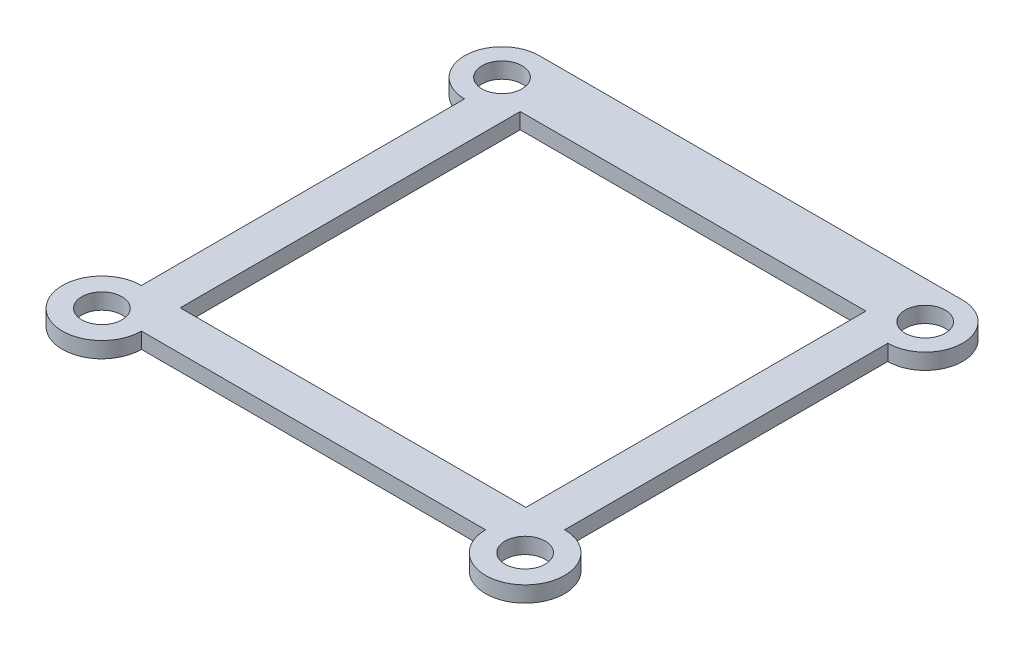
ISO-10303-21;
HEADER;
FILE_DESCRIPTION(('STEP AP214'),'2;1');
FILE_NAME('part.step','',(''),(''),'','','');
FILE_SCHEMA(('AUTOMOTIVE_DESIGN { 1 0 10303 214 1 1 1 1 }'));
ENDSEC;
DATA;
#1=APPLICATION_CONTEXT('core data for automotive mechanical design processes');
#2=APPLICATION_PROTOCOL_DEFINITION('international standard','automotive_design',2000,#1);
#3=PRODUCT_CONTEXT('',#1,'mechanical');
#4=PRODUCT('Part','Part','',(#3));
#5=PRODUCT_RELATED_PRODUCT_CATEGORY('part','',(#4));
#6=PRODUCT_DEFINITION_FORMATION('','',#4);
#7=PRODUCT_DEFINITION_CONTEXT('part definition',#1,'design');
#8=PRODUCT_DEFINITION('design','',#6,#7);
#9=PRODUCT_DEFINITION_SHAPE('','',#8);
#10=(LENGTH_UNIT() NAMED_UNIT(*) SI_UNIT(.MILLI.,.METRE.));
#11=(NAMED_UNIT(*) PLANE_ANGLE_UNIT() SI_UNIT($,.RADIAN.));
#12=(NAMED_UNIT(*) SI_UNIT($,.STERADIAN.) SOLID_ANGLE_UNIT());
#13=UNCERTAINTY_MEASURE_WITH_UNIT(LENGTH_MEASURE(1.E-05),#10,'distance_accuracy_value','');
#14=(GEOMETRIC_REPRESENTATION_CONTEXT(3) GLOBAL_UNCERTAINTY_ASSIGNED_CONTEXT((#13)) GLOBAL_UNIT_ASSIGNED_CONTEXT((#10,
#11,#12)) REPRESENTATION_CONTEXT('',''));
#15=CARTESIAN_POINT('',(0.,0.,0.));
#16=DIRECTION('',(0.,0.,1.));
#17=DIRECTION('',(1.,0.,0.));
#18=AXIS2_PLACEMENT_3D('',#15,#16,#17);
#19=CARTESIAN_POINT('',(-8.84,1.4,-13.0811034941735));
#20=DIRECTION('',(0.,1.,0.));
#21=DIRECTION('',(0.,0.,1.));
#22=AXIS2_PLACEMENT_3D('',#19,#20,#21);
#23=PLANE('',#22);
#24=CARTESIAN_POINT('',(-8.84,1.4,-13.0811034941735));
#25=DIRECTION('',(0.,1.,0.));
#26=DIRECTION('',(0.,0.,1.));
#27=AXIS2_PLACEMENT_3D('',#24,#25,#26);
#28=CIRCLE('',#27,1.77004043483272);
#29=CARTESIAN_POINT('',(-8.84,1.4,-11.3110630593408));
#30=VERTEX_POINT('',#29);
#31=EDGE_CURVE('E164',#30,#30,#28,.T.);
#32=ORIENTED_EDGE('',*,*,#31,.F.);
#33=EDGE_LOOP('',(#32));
#34=FACE_BOUND('',#33,.T.);
#35=CARTESIAN_POINT('',(-8.84,1.4,-48.3811034941736));
#36=DIRECTION('',(0.,1.,0.));
#37=DIRECTION('',(0.,0.,1.));
#38=AXIS2_PLACEMENT_3D('',#35,#36,#37);
#39=CIRCLE('',#38,1.77004043483272);
#40=CARTESIAN_POINT('',(-8.84,1.4,-46.6110630593408));
#41=VERTEX_POINT('',#40);
#42=EDGE_CURVE('E176',#41,#41,#39,.T.);
#43=ORIENTED_EDGE('',*,*,#42,.F.);
#44=EDGE_LOOP('',(#43));
#45=FACE_BOUND('',#44,.T.);
#46=CARTESIAN_POINT('',(-8.84,1.4,-13.0811034941735));
#47=DIRECTION('',(0.,1.,0.));
#48=DIRECTION('',(0.,0.,1.));
#49=AXIS2_PLACEMENT_3D('',#46,#47,#48);
#50=CIRCLE('',#49,3.48791185901081);
#51=CARTESIAN_POINT('',(-8.84,1.4,-16.5690153531844));
#52=VERTEX_POINT('',#51);
#53=CARTESIAN_POINT('',(-5.35208814098919,1.4,-13.0811034941735));
#54=VERTEX_POINT('',#53);
#55=EDGE_CURVE('E182',#52,#54,#50,.T.);
#56=ORIENTED_EDGE('',*,*,#55,.T.);
#57=DIRECTION('',(1.,0.,0.));
#58=VECTOR('',#57,1.);
#59=CARTESIAN_POINT('',(-5.35208814098919,1.4,-13.0811034941735));
#60=LINE('',#59,#58);
#61=CARTESIAN_POINT('',(25.0120881409892,1.4,-13.0811034941735));
#62=VERTEX_POINT('',#61);
#63=EDGE_CURVE('E185',#54,#62,#60,.T.);
#64=ORIENTED_EDGE('',*,*,#63,.T.);
#65=CARTESIAN_POINT('',(28.5,1.4,-13.0811034941735));
#66=DIRECTION('',(0.,1.,0.));
#67=DIRECTION('',(0.,0.,-1.));
#68=AXIS2_PLACEMENT_3D('',#65,#66,#67);
#69=CIRCLE('',#68,3.48791185901081);
#70=CARTESIAN_POINT('',(28.5,1.4,-16.5690153531844));
#71=VERTEX_POINT('',#70);
#72=EDGE_CURVE('E188',#62,#71,#69,.T.);
#73=ORIENTED_EDGE('',*,*,#72,.T.);
#74=DIRECTION('',(0.,0.,-1.));
#75=VECTOR('',#74,1.);
#76=CARTESIAN_POINT('',(28.5,1.4,-45.0811034941735));
#77=LINE('',#76,#75);
#78=CARTESIAN_POINT('',(28.5,1.4,-45.0811034941735));
#79=VERTEX_POINT('',#78);
#80=EDGE_CURVE('E190',#71,#79,#77,.T.);
#81=ORIENTED_EDGE('',*,*,#80,.T.);
#82=CARTESIAN_POINT('',(28.5,1.4,-48.3811034941736));
#83=DIRECTION('',(0.,1.,0.));
#84=DIRECTION('',(0.,0.,-1.));
#85=AXIS2_PLACEMENT_3D('',#82,#83,#84);
#86=CIRCLE('',#85,3.3);
#87=CARTESIAN_POINT('',(28.5,1.4,-51.6811034941736));
#88=VERTEX_POINT('',#87);
#89=EDGE_CURVE('E192',#79,#88,#86,.T.);
#90=ORIENTED_EDGE('',*,*,#89,.T.);
#91=DIRECTION('',(-1.,0.,0.));
#92=VECTOR('',#91,1.);
#93=CARTESIAN_POINT('',(-8.84,1.4,-51.6811034941736));
#94=LINE('',#93,#92);
#95=CARTESIAN_POINT('',(-8.84,1.4,-51.6811034941736));
#96=VERTEX_POINT('',#95);
#97=EDGE_CURVE('E194',#88,#96,#94,.T.);
#98=ORIENTED_EDGE('',*,*,#97,.T.);
#99=CARTESIAN_POINT('',(-8.84,1.4,-48.3811034941736));
#100=DIRECTION('',(0.,1.,0.));
#101=DIRECTION('',(0.,0.,1.));
#102=AXIS2_PLACEMENT_3D('',#99,#100,#101);
#103=CIRCLE('',#102,3.3);
#104=CARTESIAN_POINT('',(-8.84,1.4,-45.0811034941735));
#105=VERTEX_POINT('',#104);
#106=EDGE_CURVE('E196',#96,#105,#103,.T.);
#107=ORIENTED_EDGE('',*,*,#106,.T.);
#108=DIRECTION('',(0.,0.,1.));
#109=VECTOR('',#108,1.);
#110=CARTESIAN_POINT('',(-8.84,1.4,-45.0811034941735));
#111=LINE('',#110,#109);
#112=EDGE_CURVE('E198',#105,#52,#111,.T.);
#113=ORIENTED_EDGE('',*,*,#112,.T.);
#114=EDGE_LOOP('',(#56,#64,#73,#81,#90,#98,#107,#113));
#115=FACE_BOUND('',#114,.T.);
#116=CARTESIAN_POINT('',(28.5,1.4,-48.3811034941736));
#117=DIRECTION('',(0.,1.,0.));
#118=DIRECTION('',(0.,0.,1.));
#119=AXIS2_PLACEMENT_3D('',#116,#117,#118);
#120=CIRCLE('',#119,1.77004043483272);
#121=CARTESIAN_POINT('',(28.5,1.4,-46.6110630593408));
#122=VERTEX_POINT('',#121);
#123=EDGE_CURVE('E170',#122,#122,#120,.T.);
#124=ORIENTED_EDGE('',*,*,#123,.F.);
#125=EDGE_LOOP('',(#124));
#126=FACE_BOUND('',#125,.T.);
#127=CARTESIAN_POINT('',(28.5,1.4,-13.0811034941735));
#128=DIRECTION('',(0.,1.,0.));
#129=DIRECTION('',(0.,0.,1.));
#130=AXIS2_PLACEMENT_3D('',#127,#128,#129);
#131=CIRCLE('',#130,1.77004043483272);
#132=CARTESIAN_POINT('',(28.5,1.4,-11.3110630593408));
#133=VERTEX_POINT('',#132);
#134=EDGE_CURVE('E158',#133,#133,#131,.T.);
#135=ORIENTED_EDGE('',*,*,#134,.F.);
#136=EDGE_LOOP('',(#135));
#137=FACE_BOUND('',#136,.T.);
#138=DIRECTION('',(1.,0.,0.));
#139=VECTOR('',#138,1.);
#140=CARTESIAN_POINT('',(-5.41999999999999,1.4,-16.5690153531844));
#141=LINE('',#140,#139);
#142=CARTESIAN_POINT('',(-5.41999999999999,1.4,-16.5690153531844));
#143=VERTEX_POINT('',#142);
#144=CARTESIAN_POINT('',(25.08,1.4,-16.5690153531844));
#145=VERTEX_POINT('',#144);
#146=EDGE_CURVE('E130',#143,#145,#141,.T.);
#147=ORIENTED_EDGE('',*,*,#146,.F.);
#148=DIRECTION('',(0.,0.,1.));
#149=VECTOR('',#148,1.);
#150=CARTESIAN_POINT('',(-5.42,1.4,-46.5690153531844));
#151=LINE('',#150,#149);
#152=CARTESIAN_POINT('',(-5.42,1.4,-46.5690153531844));
#153=VERTEX_POINT('',#152);
#154=EDGE_CURVE('E122',#153,#143,#151,.T.);
#155=ORIENTED_EDGE('',*,*,#154,.F.);
#156=DIRECTION('',(-1.,0.,0.));
#157=VECTOR('',#156,1.);
#158=CARTESIAN_POINT('',(-5.42,1.4,-46.5690153531844));
#159=LINE('',#158,#157);
#160=CARTESIAN_POINT('',(25.08,1.4,-46.5690153531844));
#161=VERTEX_POINT('',#160);
#162=EDGE_CURVE('E144',#161,#153,#159,.T.);
#163=ORIENTED_EDGE('',*,*,#162,.F.);
#164=DIRECTION('',(0.,0.,-1.));
#165=VECTOR('',#164,1.);
#166=CARTESIAN_POINT('',(25.08,1.4,-46.5690153531844));
#167=LINE('',#166,#165);
#168=EDGE_CURVE('E142',#145,#161,#167,.T.);
#169=ORIENTED_EDGE('',*,*,#168,.F.);
#170=EDGE_LOOP('',(#147,#155,#163,#169));
#171=FACE_BOUND('',#170,.T.);
#172=ADVANCED_FACE('F33',(#34,#45,#115,#126,#137,#171),#23,.T.);
#173=CARTESIAN_POINT('',(-8.84,0.,-13.0811034941735));
#174=DIRECTION('',(0.,1.,0.));
#175=DIRECTION('',(0.,0.,1.));
#176=AXIS2_PLACEMENT_3D('',#173,#174,#175);
#177=PLANE('',#176);
#178=CARTESIAN_POINT('',(28.5,0.,-13.0811034941735));
#179=DIRECTION('',(0.,1.,0.));
#180=DIRECTION('',(0.,0.,1.));
#181=AXIS2_PLACEMENT_3D('',#178,#179,#180);
#182=CIRCLE('',#181,1.77004043483272);
#183=CARTESIAN_POINT('',(28.5,0.,-11.3110630593408));
#184=VERTEX_POINT('',#183);
#185=EDGE_CURVE('E138',#184,#184,#182,.T.);
#186=ORIENTED_EDGE('',*,*,#185,.T.);
#187=EDGE_LOOP('',(#186));
#188=FACE_BOUND('',#187,.T.);
#189=CARTESIAN_POINT('',(-8.84,0.,-13.0811034941735));
#190=DIRECTION('',(0.,1.,0.));
#191=DIRECTION('',(0.,0.,1.));
#192=AXIS2_PLACEMENT_3D('',#189,#190,#191);
#193=CIRCLE('',#192,1.77004043483272);
#194=CARTESIAN_POINT('',(-8.84,0.,-11.3110630593408));
#195=VERTEX_POINT('',#194);
#196=EDGE_CURVE('E161',#195,#195,#193,.T.);
#197=ORIENTED_EDGE('',*,*,#196,.T.);
#198=EDGE_LOOP('',(#197));
#199=FACE_BOUND('',#198,.T.);
#200=CARTESIAN_POINT('',(28.5,0.,-48.3811034941736));
#201=DIRECTION('',(0.,1.,0.));
#202=DIRECTION('',(0.,0.,1.));
#203=AXIS2_PLACEMENT_3D('',#200,#201,#202);
#204=CIRCLE('',#203,1.77004043483272);
#205=CARTESIAN_POINT('',(28.5,0.,-46.6110630593408));
#206=VERTEX_POINT('',#205);
#207=EDGE_CURVE('E167',#206,#206,#204,.T.);
#208=ORIENTED_EDGE('',*,*,#207,.T.);
#209=EDGE_LOOP('',(#208));
#210=FACE_BOUND('',#209,.T.);
#211=CARTESIAN_POINT('',(-8.84,0.,-48.3811034941736));
#212=DIRECTION('',(0.,1.,0.));
#213=DIRECTION('',(0.,0.,1.));
#214=AXIS2_PLACEMENT_3D('',#211,#212,#213);
#215=CIRCLE('',#214,1.77004043483272);
#216=CARTESIAN_POINT('',(-8.84,0.,-46.6110630593408));
#217=VERTEX_POINT('',#216);
#218=EDGE_CURVE('E173',#217,#217,#215,.T.);
#219=ORIENTED_EDGE('',*,*,#218,.T.);
#220=EDGE_LOOP('',(#219));
#221=FACE_BOUND('',#220,.T.);
#222=CARTESIAN_POINT('',(-8.84,0.,-13.0811034941735));
#223=DIRECTION('',(0.,1.,0.));
#224=DIRECTION('',(0.,0.,1.));
#225=AXIS2_PLACEMENT_3D('',#222,#223,#224);
#226=CIRCLE('',#225,3.48791185901081);
#227=CARTESIAN_POINT('',(-8.84,0.,-16.5690153531844));
#228=VERTEX_POINT('',#227);
#229=CARTESIAN_POINT('',(-5.35208814098919,0.,-13.0811034941735));
#230=VERTEX_POINT('',#229);
#231=EDGE_CURVE('E179',#228,#230,#226,.T.);
#232=ORIENTED_EDGE('',*,*,#231,.F.);
#233=DIRECTION('',(0.,0.,1.));
#234=VECTOR('',#233,1.);
#235=CARTESIAN_POINT('',(-8.84,0.,-45.0811034941735));
#236=LINE('',#235,#234);
#237=CARTESIAN_POINT('',(-8.84,0.,-45.0811034941735));
#238=VERTEX_POINT('',#237);
#239=EDGE_CURVE('E186',#238,#228,#236,.T.);
#240=ORIENTED_EDGE('',*,*,#239,.F.);
#241=CARTESIAN_POINT('',(-8.84,0.,-48.3811034941736));
#242=DIRECTION('',(0.,1.,0.));
#243=DIRECTION('',(0.,0.,1.));
#244=AXIS2_PLACEMENT_3D('',#241,#242,#243);
#245=CIRCLE('',#244,3.3);
#246=CARTESIAN_POINT('',(-8.84,0.,-51.6811034941736));
#247=VERTEX_POINT('',#246);
#248=EDGE_CURVE('E213',#247,#238,#245,.T.);
#249=ORIENTED_EDGE('',*,*,#248,.F.);
#250=DIRECTION('',(-1.,0.,0.));
#251=VECTOR('',#250,1.);
#252=CARTESIAN_POINT('',(-8.84,0.,-51.6811034941736));
#253=LINE('',#252,#251);
#254=CARTESIAN_POINT('',(28.5,0.,-51.6811034941736));
#255=VERTEX_POINT('',#254);
#256=EDGE_CURVE('E211',#255,#247,#253,.T.);
#257=ORIENTED_EDGE('',*,*,#256,.F.);
#258=CARTESIAN_POINT('',(28.5,0.,-48.3811034941736));
#259=DIRECTION('',(0.,1.,0.));
#260=DIRECTION('',(0.,0.,-1.));
#261=AXIS2_PLACEMENT_3D('',#258,#259,#260);
#262=CIRCLE('',#261,3.3);
#263=CARTESIAN_POINT('',(28.5,0.,-45.0811034941735));
#264=VERTEX_POINT('',#263);
#265=EDGE_CURVE('E209',#264,#255,#262,.T.);
#266=ORIENTED_EDGE('',*,*,#265,.F.);
#267=DIRECTION('',(0.,0.,-1.));
#268=VECTOR('',#267,1.);
#269=CARTESIAN_POINT('',(28.5,0.,-45.0811034941735));
#270=LINE('',#269,#268);
#271=CARTESIAN_POINT('',(28.5,0.,-16.5690153531844));
#272=VERTEX_POINT('',#271);
#273=EDGE_CURVE('E207',#272,#264,#270,.T.);
#274=ORIENTED_EDGE('',*,*,#273,.F.);
#275=CARTESIAN_POINT('',(28.5,0.,-13.0811034941735));
#276=DIRECTION('',(0.,1.,0.));
#277=DIRECTION('',(0.,0.,-1.));
#278=AXIS2_PLACEMENT_3D('',#275,#276,#277);
#279=CIRCLE('',#278,3.48791185901081);
#280=CARTESIAN_POINT('',(25.0120881409892,0.,-13.0811034941735));
#281=VERTEX_POINT('',#280);
#282=EDGE_CURVE('E205',#281,#272,#279,.T.);
#283=ORIENTED_EDGE('',*,*,#282,.F.);
#284=DIRECTION('',(1.,0.,0.));
#285=VECTOR('',#284,1.);
#286=CARTESIAN_POINT('',(-5.35208814098919,0.,-13.0811034941735));
#287=LINE('',#286,#285);
#288=EDGE_CURVE('E203',#230,#281,#287,.T.);
#289=ORIENTED_EDGE('',*,*,#288,.F.);
#290=EDGE_LOOP('',(#232,#240,#249,#257,#266,#274,#283,#289));
#291=FACE_BOUND('',#290,.T.);
#292=DIRECTION('',(0.,0.,1.));
#293=VECTOR('',#292,1.);
#294=CARTESIAN_POINT('',(-5.42,0.,-46.5690153531844));
#295=LINE('',#294,#293);
#296=CARTESIAN_POINT('',(-5.42,0.,-46.5690153531844));
#297=VERTEX_POINT('',#296);
#298=CARTESIAN_POINT('',(-5.41999999999999,0.,-16.5690153531844));
#299=VERTEX_POINT('',#298);
#300=EDGE_CURVE('E56',#297,#299,#295,.T.);
#301=ORIENTED_EDGE('',*,*,#300,.T.);
#302=DIRECTION('',(1.,0.,0.));
#303=VECTOR('',#302,1.);
#304=CARTESIAN_POINT('',(-5.41999999999999,0.,-16.5690153531844));
#305=LINE('',#304,#303);
#306=CARTESIAN_POINT('',(25.08,0.,-16.5690153531844));
#307=VERTEX_POINT('',#306);
#308=EDGE_CURVE('E137',#299,#307,#305,.T.);
#309=ORIENTED_EDGE('',*,*,#308,.T.);
#310=DIRECTION('',(0.,0.,-1.));
#311=VECTOR('',#310,1.);
#312=CARTESIAN_POINT('',(25.08,0.,-46.5690153531844));
#313=LINE('',#312,#311);
#314=CARTESIAN_POINT('',(25.08,0.,-46.5690153531844));
#315=VERTEX_POINT('',#314);
#316=EDGE_CURVE('E150',#307,#315,#313,.T.);
#317=ORIENTED_EDGE('',*,*,#316,.T.);
#318=DIRECTION('',(-1.,0.,0.));
#319=VECTOR('',#318,1.);
#320=CARTESIAN_POINT('',(-5.42,0.,-46.5690153531844));
#321=LINE('',#320,#319);
#322=EDGE_CURVE('E131',#315,#297,#321,.T.);
#323=ORIENTED_EDGE('',*,*,#322,.T.);
#324=EDGE_LOOP('',(#301,#309,#317,#323));
#325=FACE_BOUND('',#324,.T.);
#326=ADVANCED_FACE('F243',(#188,#199,#210,#221,#291,#325),#177,.F.);
#327=CARTESIAN_POINT('',(-8.84,1.4,-13.0811034941735));
#328=DIRECTION('',(0.,-1.,0.));
#329=DIRECTION('',(0.,0.,-1.));
#330=AXIS2_PLACEMENT_3D('',#327,#328,#329);
#331=CYLINDRICAL_SURFACE('',#330,3.48791185901081);
#332=ORIENTED_EDGE('',*,*,#231,.T.);
#333=DIRECTION('',(0.,-1.,0.));
#334=VECTOR('',#333,1.);
#335=CARTESIAN_POINT('',(-5.35208814098919,1.4,-13.0811034941735));
#336=LINE('',#335,#334);
#337=EDGE_CURVE('E11',#54,#230,#336,.T.);
#338=ORIENTED_EDGE('',*,*,#337,.F.);
#339=ORIENTED_EDGE('',*,*,#55,.F.);
#340=DIRECTION('',(0.,-1.,0.));
#341=VECTOR('',#340,1.);
#342=CARTESIAN_POINT('',(-8.84,1.4,-16.5690153531844));
#343=LINE('',#342,#341);
#344=EDGE_CURVE('E200',#52,#228,#343,.T.);
#345=ORIENTED_EDGE('',*,*,#344,.T.);
#346=EDGE_LOOP('',(#332,#338,#339,#345));
#347=FACE_BOUND('',#346,.T.);
#348=ADVANCED_FACE('F35',(#347),#331,.T.);
#349=CARTESIAN_POINT('',(-5.35208814098919,1.4,-13.0811034941735));
#350=DIRECTION('',(0.,0.,-1.));
#351=DIRECTION('',(-1.,0.,0.));
#352=AXIS2_PLACEMENT_3D('',#349,#350,#351);
#353=PLANE('',#352);
#354=ORIENTED_EDGE('',*,*,#288,.T.);
#355=DIRECTION('',(0.,-1.,0.));
#356=VECTOR('',#355,1.);
#357=CARTESIAN_POINT('',(25.0120881409892,1.4,-13.0811034941735));
#358=LINE('',#357,#356);
#359=EDGE_CURVE('E41',#62,#281,#358,.T.);
#360=ORIENTED_EDGE('',*,*,#359,.F.);
#361=ORIENTED_EDGE('',*,*,#63,.F.);
#362=ORIENTED_EDGE('',*,*,#337,.T.);
#363=EDGE_LOOP('',(#354,#360,#361,#362));
#364=FACE_BOUND('',#363,.T.);
#365=ADVANCED_FACE('F261',(#364),#353,.F.);
#366=CARTESIAN_POINT('',(28.5,1.4,-13.0811034941735));
#367=DIRECTION('',(0.,-1.,0.));
#368=DIRECTION('',(0.,0.,-1.));
#369=AXIS2_PLACEMENT_3D('',#366,#367,#368);
#370=CYLINDRICAL_SURFACE('',#369,3.48791185901081);
#371=ORIENTED_EDGE('',*,*,#282,.T.);
#372=DIRECTION('',(0.,-1.,0.));
#373=VECTOR('',#372,1.);
#374=CARTESIAN_POINT('',(28.5,1.4,-16.5690153531844));
#375=LINE('',#374,#373);
#376=EDGE_CURVE('E230',#71,#272,#375,.T.);
#377=ORIENTED_EDGE('',*,*,#376,.F.);
#378=ORIENTED_EDGE('',*,*,#72,.F.);
#379=ORIENTED_EDGE('',*,*,#359,.T.);
#380=EDGE_LOOP('',(#371,#377,#378,#379));
#381=FACE_BOUND('',#380,.T.);
#382=ADVANCED_FACE('F237',(#381),#370,.T.);
#383=CARTESIAN_POINT('',(28.5,1.4,-45.0811034941735));
#384=DIRECTION('',(-1.,0.,0.));
#385=DIRECTION('',(0.,0.,1.));
#386=AXIS2_PLACEMENT_3D('',#383,#384,#385);
#387=PLANE('',#386);
#388=ORIENTED_EDGE('',*,*,#273,.T.);
#389=DIRECTION('',(0.,-1.,0.));
#390=VECTOR('',#389,1.);
#391=CARTESIAN_POINT('',(28.5,1.4,-45.0811034941735));
#392=LINE('',#391,#390);
#393=EDGE_CURVE('E227',#79,#264,#392,.T.);
#394=ORIENTED_EDGE('',*,*,#393,.F.);
#395=ORIENTED_EDGE('',*,*,#80,.F.);
#396=ORIENTED_EDGE('',*,*,#376,.T.);
#397=EDGE_LOOP('',(#388,#394,#395,#396));
#398=FACE_BOUND('',#397,.T.);
#399=ADVANCED_FACE('F249',(#398),#387,.F.);
#400=CARTESIAN_POINT('',(28.5,1.4,-48.3811034941736));
#401=DIRECTION('',(0.,-1.,0.));
#402=DIRECTION('',(0.,0.,-1.));
#403=AXIS2_PLACEMENT_3D('',#400,#401,#402);
#404=CYLINDRICAL_SURFACE('',#403,3.3);
#405=ORIENTED_EDGE('',*,*,#265,.T.);
#406=DIRECTION('',(0.,-1.,0.));
#407=VECTOR('',#406,1.);
#408=CARTESIAN_POINT('',(28.5,1.4,-51.6811034941736));
#409=LINE('',#408,#407);
#410=EDGE_CURVE('E224',#88,#255,#409,.T.);
#411=ORIENTED_EDGE('',*,*,#410,.F.);
#412=ORIENTED_EDGE('',*,*,#89,.F.);
#413=ORIENTED_EDGE('',*,*,#393,.T.);
#414=EDGE_LOOP('',(#405,#411,#412,#413));
#415=FACE_BOUND('',#414,.T.);
#416=ADVANCED_FACE('F253',(#415),#404,.T.);
#417=CARTESIAN_POINT('',(-8.84,1.4,-51.6811034941736));
#418=DIRECTION('',(0.,0.,1.));
#419=DIRECTION('',(1.,0.,0.));
#420=AXIS2_PLACEMENT_3D('',#417,#418,#419);
#421=PLANE('',#420);
#422=ORIENTED_EDGE('',*,*,#256,.T.);
#423=DIRECTION('',(0.,-1.,0.));
#424=VECTOR('',#423,1.);
#425=CARTESIAN_POINT('',(-8.84,1.4,-51.6811034941736));
#426=LINE('',#425,#424);
#427=EDGE_CURVE('E221',#96,#247,#426,.T.);
#428=ORIENTED_EDGE('',*,*,#427,.F.);
#429=ORIENTED_EDGE('',*,*,#97,.F.);
#430=ORIENTED_EDGE('',*,*,#410,.T.);
#431=EDGE_LOOP('',(#422,#428,#429,#430));
#432=FACE_BOUND('',#431,.T.);
#433=ADVANCED_FACE('F274',(#432),#421,.F.);
#434=CARTESIAN_POINT('',(-8.84,1.4,-48.3811034941736));
#435=DIRECTION('',(0.,-1.,0.));
#436=DIRECTION('',(0.,0.,-1.));
#437=AXIS2_PLACEMENT_3D('',#434,#435,#436);
#438=CYLINDRICAL_SURFACE('',#437,3.3);
#439=ORIENTED_EDGE('',*,*,#248,.T.);
#440=DIRECTION('',(0.,-1.,0.));
#441=VECTOR('',#440,1.);
#442=CARTESIAN_POINT('',(-8.84,1.4,-45.0811034941735));
#443=LINE('',#442,#441);
#444=EDGE_CURVE('E218',#105,#238,#443,.T.);
#445=ORIENTED_EDGE('',*,*,#444,.F.);
#446=ORIENTED_EDGE('',*,*,#106,.F.);
#447=ORIENTED_EDGE('',*,*,#427,.T.);
#448=EDGE_LOOP('',(#439,#445,#446,#447));
#449=FACE_BOUND('',#448,.T.);
#450=ADVANCED_FACE('F272',(#449),#438,.T.);
#451=CARTESIAN_POINT('',(-8.84,1.4,-45.0811034941735));
#452=DIRECTION('',(1.,0.,0.));
#453=DIRECTION('',(0.,0.,-1.));
#454=AXIS2_PLACEMENT_3D('',#451,#452,#453);
#455=PLANE('',#454);
#456=ORIENTED_EDGE('',*,*,#239,.T.);
#457=ORIENTED_EDGE('',*,*,#344,.F.);
#458=ORIENTED_EDGE('',*,*,#112,.F.);
#459=ORIENTED_EDGE('',*,*,#444,.T.);
#460=EDGE_LOOP('',(#456,#457,#458,#459));
#461=FACE_BOUND('',#460,.T.);
#462=ADVANCED_FACE('F267',(#461),#455,.F.);
#463=CARTESIAN_POINT('',(-8.84,1.4,-48.3811034941736));
#464=DIRECTION('',(0.,-1.,0.));
#465=DIRECTION('',(0.,0.,-1.));
#466=AXIS2_PLACEMENT_3D('',#463,#464,#465);
#467=CYLINDRICAL_SURFACE('',#466,1.77004043483272);
#468=ORIENTED_EDGE('',*,*,#42,.T.);
#469=EDGE_LOOP('',(#468));
#470=FACE_BOUND('',#469,.T.);
#471=ORIENTED_EDGE('',*,*,#218,.F.);
#472=EDGE_LOOP('',(#471));
#473=FACE_BOUND('',#472,.T.);
#474=ADVANCED_FACE('F294',(#470,#473),#467,.F.);
#475=CARTESIAN_POINT('',(28.5,1.4,-48.3811034941736));
#476=DIRECTION('',(0.,-1.,0.));
#477=DIRECTION('',(0.,0.,-1.));
#478=AXIS2_PLACEMENT_3D('',#475,#476,#477);
#479=CYLINDRICAL_SURFACE('',#478,1.77004043483272);
#480=ORIENTED_EDGE('',*,*,#123,.T.);
#481=EDGE_LOOP('',(#480));
#482=FACE_BOUND('',#481,.T.);
#483=ORIENTED_EDGE('',*,*,#207,.F.);
#484=EDGE_LOOP('',(#483));
#485=FACE_BOUND('',#484,.T.);
#486=ADVANCED_FACE('F301',(#482,#485),#479,.F.);
#487=CARTESIAN_POINT('',(-8.84,1.4,-13.0811034941735));
#488=DIRECTION('',(0.,-1.,0.));
#489=DIRECTION('',(0.,0.,-1.));
#490=AXIS2_PLACEMENT_3D('',#487,#488,#489);
#491=CYLINDRICAL_SURFACE('',#490,1.77004043483272);
#492=ORIENTED_EDGE('',*,*,#31,.T.);
#493=EDGE_LOOP('',(#492));
#494=FACE_BOUND('',#493,.T.);
#495=ORIENTED_EDGE('',*,*,#196,.F.);
#496=EDGE_LOOP('',(#495));
#497=FACE_BOUND('',#496,.T.);
#498=ADVANCED_FACE('F306',(#494,#497),#491,.F.);
#499=CARTESIAN_POINT('',(28.5,1.4,-13.0811034941735));
#500=DIRECTION('',(0.,-1.,0.));
#501=DIRECTION('',(0.,0.,-1.));
#502=AXIS2_PLACEMENT_3D('',#499,#500,#501);
#503=CYLINDRICAL_SURFACE('',#502,1.77004043483272);
#504=ORIENTED_EDGE('',*,*,#134,.T.);
#505=EDGE_LOOP('',(#504));
#506=FACE_BOUND('',#505,.T.);
#507=ORIENTED_EDGE('',*,*,#185,.F.);
#508=EDGE_LOOP('',(#507));
#509=FACE_BOUND('',#508,.T.);
#510=ADVANCED_FACE('F315',(#506,#509),#503,.F.);
#511=CARTESIAN_POINT('',(-5.42,1.4,-46.5690153531844));
#512=DIRECTION('',(1.,0.,0.));
#513=DIRECTION('',(0.,0.,-1.));
#514=AXIS2_PLACEMENT_3D('',#511,#512,#513);
#515=PLANE('',#514);
#516=ORIENTED_EDGE('',*,*,#300,.F.);
#517=DIRECTION('',(0.,-1.,0.));
#518=VECTOR('',#517,1.);
#519=CARTESIAN_POINT('',(-5.42,1.4,-46.5690153531844));
#520=LINE('',#519,#518);
#521=EDGE_CURVE('E126',#153,#297,#520,.T.);
#522=ORIENTED_EDGE('',*,*,#521,.F.);
#523=ORIENTED_EDGE('',*,*,#154,.T.);
#524=DIRECTION('',(0.,-1.,0.));
#525=VECTOR('',#524,1.);
#526=CARTESIAN_POINT('',(-5.41999999999999,1.4,-16.5690153531844));
#527=LINE('',#526,#525);
#528=EDGE_CURVE('E125',#143,#299,#527,.T.);
#529=ORIENTED_EDGE('',*,*,#528,.T.);
#530=EDGE_LOOP('',(#516,#522,#523,#529));
#531=FACE_BOUND('',#530,.T.);
#532=ADVANCED_FACE('F124',(#531),#515,.T.);
#533=CARTESIAN_POINT('',(-5.41999999999999,1.4,-16.5690153531844));
#534=DIRECTION('',(0.,0.,-1.));
#535=DIRECTION('',(-1.,0.,0.));
#536=AXIS2_PLACEMENT_3D('',#533,#534,#535);
#537=PLANE('',#536);
#538=ORIENTED_EDGE('',*,*,#308,.F.);
#539=ORIENTED_EDGE('',*,*,#528,.F.);
#540=ORIENTED_EDGE('',*,*,#146,.T.);
#541=DIRECTION('',(0.,-1.,0.));
#542=VECTOR('',#541,1.);
#543=CARTESIAN_POINT('',(25.08,1.4,-16.5690153531844));
#544=LINE('',#543,#542);
#545=EDGE_CURVE('E139',#145,#307,#544,.T.);
#546=ORIENTED_EDGE('',*,*,#545,.T.);
#547=EDGE_LOOP('',(#538,#539,#540,#546));
#548=FACE_BOUND('',#547,.T.);
#549=ADVANCED_FACE('F134',(#548),#537,.T.);
#550=CARTESIAN_POINT('',(25.08,1.4,-46.5690153531844));
#551=DIRECTION('',(-1.,0.,0.));
#552=DIRECTION('',(0.,0.,1.));
#553=AXIS2_PLACEMENT_3D('',#550,#551,#552);
#554=PLANE('',#553);
#555=ORIENTED_EDGE('',*,*,#316,.F.);
#556=ORIENTED_EDGE('',*,*,#545,.F.);
#557=ORIENTED_EDGE('',*,*,#168,.T.);
#558=DIRECTION('',(0.,-1.,0.));
#559=VECTOR('',#558,1.);
#560=CARTESIAN_POINT('',(25.08,1.4,-46.5690153531844));
#561=LINE('',#560,#559);
#562=EDGE_CURVE('E48',#161,#315,#561,.T.);
#563=ORIENTED_EDGE('',*,*,#562,.T.);
#564=EDGE_LOOP('',(#555,#556,#557,#563));
#565=FACE_BOUND('',#564,.T.);
#566=ADVANCED_FACE('F327',(#565),#554,.T.);
#567=CARTESIAN_POINT('',(-5.42,1.4,-46.5690153531844));
#568=DIRECTION('',(0.,0.,1.));
#569=DIRECTION('',(1.,0.,0.));
#570=AXIS2_PLACEMENT_3D('',#567,#568,#569);
#571=PLANE('',#570);
#572=ORIENTED_EDGE('',*,*,#322,.F.);
#573=ORIENTED_EDGE('',*,*,#562,.F.);
#574=ORIENTED_EDGE('',*,*,#162,.T.);
#575=ORIENTED_EDGE('',*,*,#521,.T.);
#576=EDGE_LOOP('',(#572,#573,#574,#575));
#577=FACE_BOUND('',#576,.T.);
#578=ADVANCED_FACE('F330',(#577),#571,.T.);
#579=CLOSED_SHELL('',(#172,#326,#348,#365,#382,#399,#416,#433,#450,#462,#474,#486,#498,#510,
#532,#549,#566,#578));
#580=MANIFOLD_SOLID_BREP('B2',#579);
#581=ADVANCED_BREP_SHAPE_REPRESENTATION('',(#18,#580),#14);
#582=SHAPE_DEFINITION_REPRESENTATION(#9,#581);
ENDSEC;
END-ISO-10303-21;
